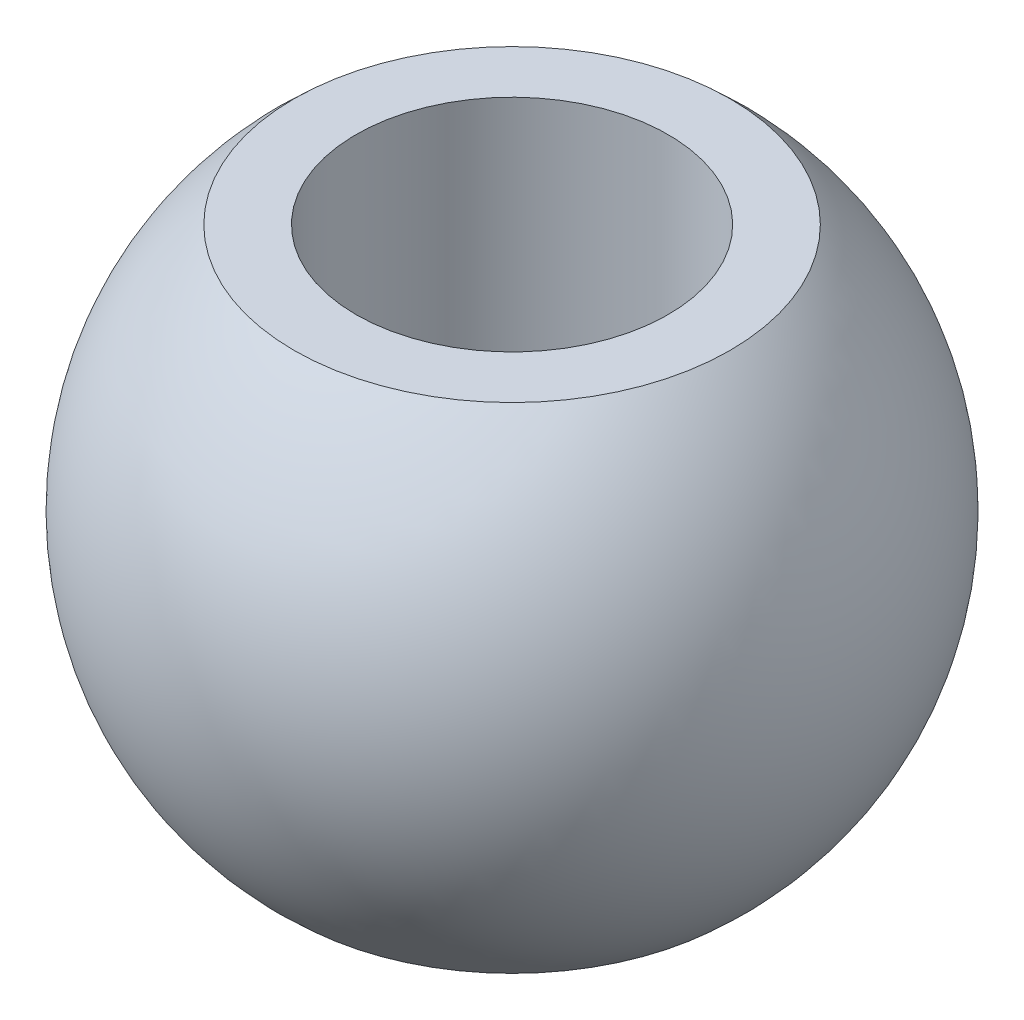
ISO-10303-21;
HEADER;
FILE_DESCRIPTION(('STEP AP214'),'2;1');
FILE_NAME('part.step','',(''),(''),'','','');
FILE_SCHEMA(('AUTOMOTIVE_DESIGN { 1 0 10303 214 1 1 1 1 }'));
ENDSEC;
DATA;
#1=APPLICATION_CONTEXT('core data for automotive mechanical design processes');
#2=APPLICATION_PROTOCOL_DEFINITION('international standard','automotive_design',2000,#1);
#3=PRODUCT_CONTEXT('',#1,'mechanical');
#4=PRODUCT('Part','Part','',(#3));
#5=PRODUCT_RELATED_PRODUCT_CATEGORY('part','',(#4));
#6=PRODUCT_DEFINITION_FORMATION('','',#4);
#7=PRODUCT_DEFINITION_CONTEXT('part definition',#1,'design');
#8=PRODUCT_DEFINITION('design','',#6,#7);
#9=PRODUCT_DEFINITION_SHAPE('','',#8);
#10=(LENGTH_UNIT() NAMED_UNIT(*) SI_UNIT(.MILLI.,.METRE.));
#11=(NAMED_UNIT(*) PLANE_ANGLE_UNIT() SI_UNIT($,.RADIAN.));
#12=(NAMED_UNIT(*) SI_UNIT($,.STERADIAN.) SOLID_ANGLE_UNIT());
#13=UNCERTAINTY_MEASURE_WITH_UNIT(LENGTH_MEASURE(1.E-05),#10,'distance_accuracy_value','');
#14=(GEOMETRIC_REPRESENTATION_CONTEXT(3) GLOBAL_UNCERTAINTY_ASSIGNED_CONTEXT((#13)) GLOBAL_UNIT_ASSIGNED_CONTEXT((#10,
#11,#12)) REPRESENTATION_CONTEXT('',''));
#15=CARTESIAN_POINT('',(0.,0.,0.));
#16=DIRECTION('',(0.,0.,1.));
#17=DIRECTION('',(1.,0.,0.));
#18=AXIS2_PLACEMENT_3D('',#15,#16,#17);
#19=CARTESIAN_POINT('',(0.,0.,0.));
#20=DIRECTION('',(0.,1.,0.));
#21=DIRECTION('',(1.,0.,0.));
#22=AXIS2_PLACEMENT_3D('',#19,#20,#21);
#23=SPHERICAL_SURFACE('',#22,2.3876);
#24=CARTESIAN_POINT('',(0.,1.7907,0.));
#25=DIRECTION('',(0.,1.,0.));
#26=DIRECTION('',(0.,0.,1.));
#27=AXIS2_PLACEMENT_3D('',#24,#25,#26);
#28=CIRCLE('',#27,1.57924895757445);
#29=CARTESIAN_POINT('',(0.,1.7907,1.57924895757445));
#30=VERTEX_POINT('',#29);
#31=EDGE_CURVE('E10',#30,#30,#28,.T.);
#32=ORIENTED_EDGE('',*,*,#31,.F.);
#33=EDGE_LOOP('',(#32));
#34=FACE_BOUND('',#33,.T.);
#35=CARTESIAN_POINT('',(0.,-1.7907,0.));
#36=DIRECTION('',(0.,-1.,0.));
#37=DIRECTION('',(0.,0.,-1.));
#38=AXIS2_PLACEMENT_3D('',#35,#36,#37);
#39=CIRCLE('',#38,1.57924895757445);
#40=CARTESIAN_POINT('',(0.,-1.7907,-1.57924895757445));
#41=VERTEX_POINT('',#40);
#42=EDGE_CURVE('E39',#41,#41,#39,.T.);
#43=ORIENTED_EDGE('',*,*,#42,.F.);
#44=EDGE_LOOP('',(#43));
#45=FACE_BOUND('',#44,.T.);
#46=ADVANCED_FACE('F36',(#34,#45),#23,.T.);
#47=CARTESIAN_POINT('',(0.,1.7907,0.));
#48=DIRECTION('',(0.,1.,0.));
#49=DIRECTION('',(0.,0.,1.));
#50=AXIS2_PLACEMENT_3D('',#47,#48,#49);
#51=PLANE('',#50);
#52=CARTESIAN_POINT('',(0.,1.7907,0.));
#53=DIRECTION('',(0.,1.,0.));
#54=DIRECTION('',(0.,0.,1.));
#55=AXIS2_PLACEMENT_3D('',#52,#53,#54);
#56=CIRCLE('',#55,1.1303);
#57=CARTESIAN_POINT('',(0.,1.7907,1.1303));
#58=VERTEX_POINT('',#57);
#59=EDGE_CURVE('E51',#58,#58,#56,.T.);
#60=ORIENTED_EDGE('',*,*,#59,.F.);
#61=EDGE_LOOP('',(#60));
#62=FACE_BOUND('',#61,.T.);
#63=ORIENTED_EDGE('',*,*,#31,.T.);
#64=EDGE_LOOP('',(#63));
#65=FACE_BOUND('',#64,.T.);
#66=ADVANCED_FACE('F67',(#62,#65),#51,.T.);
#67=CARTESIAN_POINT('',(0.,-1.7907,0.));
#68=DIRECTION('',(0.,-1.,0.));
#69=DIRECTION('',(0.,0.,1.));
#70=AXIS2_PLACEMENT_3D('',#67,#68,#69);
#71=PLANE('',#70);
#72=CARTESIAN_POINT('',(0.,-1.7907,0.));
#73=DIRECTION('',(0.,1.,0.));
#74=DIRECTION('',(0.,0.,1.));
#75=AXIS2_PLACEMENT_3D('',#72,#73,#74);
#76=CIRCLE('',#75,1.1303);
#77=CARTESIAN_POINT('',(0.,-1.7907,1.1303));
#78=VERTEX_POINT('',#77);
#79=EDGE_CURVE('E49',#78,#78,#76,.T.);
#80=ORIENTED_EDGE('',*,*,#79,.T.);
#81=EDGE_LOOP('',(#80));
#82=FACE_BOUND('',#81,.T.);
#83=ORIENTED_EDGE('',*,*,#42,.T.);
#84=EDGE_LOOP('',(#83));
#85=FACE_BOUND('',#84,.T.);
#86=ADVANCED_FACE('F58',(#82,#85),#71,.T.);
#87=CARTESIAN_POINT('',(0.,-1.7907,0.));
#88=DIRECTION('',(0.,1.,0.));
#89=DIRECTION('',(0.,0.,1.));
#90=AXIS2_PLACEMENT_3D('',#87,#88,#89);
#91=CYLINDRICAL_SURFACE('',#90,1.1303);
#92=ORIENTED_EDGE('',*,*,#79,.F.);
#93=EDGE_LOOP('',(#92));
#94=FACE_BOUND('',#93,.T.);
#95=ORIENTED_EDGE('',*,*,#59,.T.);
#96=EDGE_LOOP('',(#95));
#97=FACE_BOUND('',#96,.T.);
#98=ADVANCED_FACE('F61',(#94,#97),#91,.F.);
#99=CLOSED_SHELL('',(#46,#66,#86,#98));
#100=MANIFOLD_SOLID_BREP('B2',#99);
#101=ADVANCED_BREP_SHAPE_REPRESENTATION('',(#18,#100),#14);
#102=SHAPE_DEFINITION_REPRESENTATION(#9,#101);
ENDSEC;
END-ISO-10303-21;
